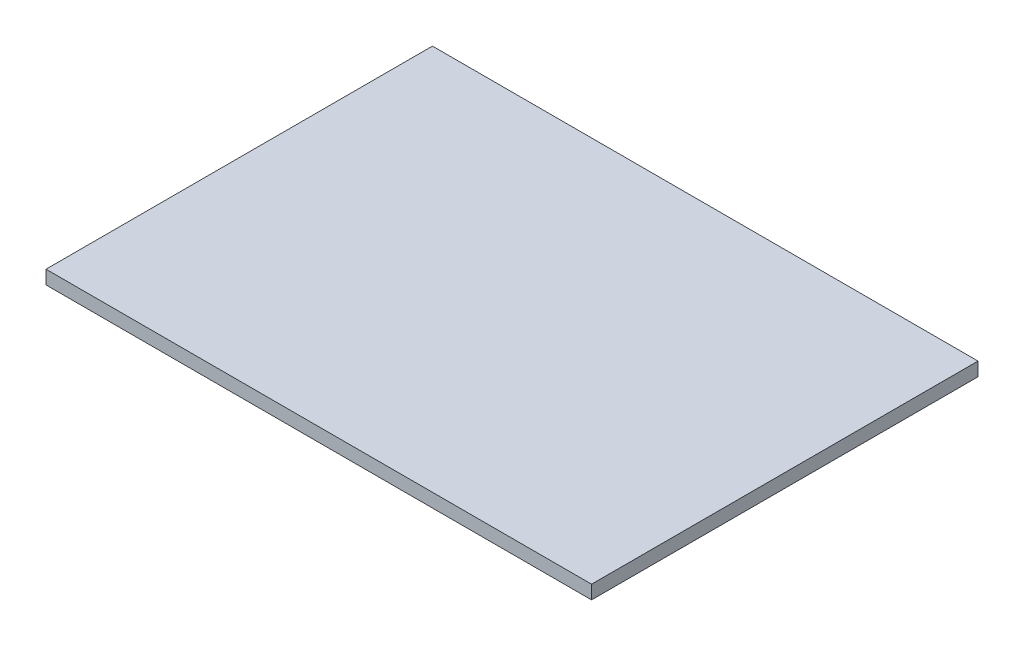
ISO-10303-21;
HEADER;
FILE_DESCRIPTION(('STEP AP214'),'2;1');
FILE_NAME('part.step','',(''),(''),'','','');
FILE_SCHEMA(('AUTOMOTIVE_DESIGN { 1 0 10303 214 1 1 1 1 }'));
ENDSEC;
DATA;
#1=APPLICATION_CONTEXT('core data for automotive mechanical design processes');
#2=APPLICATION_PROTOCOL_DEFINITION('international standard','automotive_design',2000,#1);
#3=PRODUCT_CONTEXT('',#1,'mechanical');
#4=PRODUCT('Part','Part','',(#3));
#5=PRODUCT_RELATED_PRODUCT_CATEGORY('part','',(#4));
#6=PRODUCT_DEFINITION_FORMATION('','',#4);
#7=PRODUCT_DEFINITION_CONTEXT('part definition',#1,'design');
#8=PRODUCT_DEFINITION('design','',#6,#7);
#9=PRODUCT_DEFINITION_SHAPE('','',#8);
#10=(LENGTH_UNIT() NAMED_UNIT(*) SI_UNIT(.MILLI.,.METRE.));
#11=(NAMED_UNIT(*) PLANE_ANGLE_UNIT() SI_UNIT($,.RADIAN.));
#12=(NAMED_UNIT(*) SI_UNIT($,.STERADIAN.) SOLID_ANGLE_UNIT());
#13=UNCERTAINTY_MEASURE_WITH_UNIT(LENGTH_MEASURE(1.E-05),#10,'distance_accuracy_value','');
#14=(GEOMETRIC_REPRESENTATION_CONTEXT(3) GLOBAL_UNCERTAINTY_ASSIGNED_CONTEXT((#13)) GLOBAL_UNIT_ASSIGNED_CONTEXT((#10,
#11,#12)) REPRESENTATION_CONTEXT('',''));
#15=CARTESIAN_POINT('',(0.,0.,0.));
#16=DIRECTION('',(0.,0.,1.));
#17=DIRECTION('',(1.,0.,0.));
#18=AXIS2_PLACEMENT_3D('',#15,#16,#17);
#19=CARTESIAN_POINT('',(60.,3.,-42.5));
#20=DIRECTION('',(-1.,0.,0.));
#21=DIRECTION('',(0.,0.,1.));
#22=AXIS2_PLACEMENT_3D('',#19,#20,#21);
#23=PLANE('',#22);
#24=DIRECTION('',(0.,0.,-1.));
#25=VECTOR('',#24,1.);
#26=CARTESIAN_POINT('',(60.,0.,-42.5));
#27=LINE('',#26,#25);
#28=CARTESIAN_POINT('',(60.,0.,42.5));
#29=VERTEX_POINT('',#28);
#30=CARTESIAN_POINT('',(60.,0.,-42.5));
#31=VERTEX_POINT('',#30);
#32=EDGE_CURVE('E97',#29,#31,#27,.T.);
#33=ORIENTED_EDGE('',*,*,#32,.T.);
#34=DIRECTION('',(0.,-1.,0.));
#35=VECTOR('',#34,1.);
#36=CARTESIAN_POINT('',(60.,3.,-42.5));
#37=LINE('',#36,#35);
#38=CARTESIAN_POINT('',(60.,3.,-42.5));
#39=VERTEX_POINT('',#38);
#40=EDGE_CURVE('E11',#39,#31,#37,.T.);
#41=ORIENTED_EDGE('',*,*,#40,.F.);
#42=DIRECTION('',(0.,0.,-1.));
#43=VECTOR('',#42,1.);
#44=CARTESIAN_POINT('',(60.,3.,-42.5));
#45=LINE('',#44,#43);
#46=CARTESIAN_POINT('',(60.,3.,42.5));
#47=VERTEX_POINT('',#46);
#48=EDGE_CURVE('E85',#47,#39,#45,.T.);
#49=ORIENTED_EDGE('',*,*,#48,.F.);
#50=DIRECTION('',(0.,-1.,0.));
#51=VECTOR('',#50,1.);
#52=CARTESIAN_POINT('',(60.,3.,42.5));
#53=LINE('',#52,#51);
#54=EDGE_CURVE('E93',#47,#29,#53,.T.);
#55=ORIENTED_EDGE('',*,*,#54,.T.);
#56=EDGE_LOOP('',(#33,#41,#49,#55));
#57=FACE_BOUND('',#56,.T.);
#58=ADVANCED_FACE('F34',(#57),#23,.F.);
#59=CARTESIAN_POINT('',(-60.,3.,-42.5));
#60=DIRECTION('',(0.,0.,1.));
#61=DIRECTION('',(1.,0.,0.));
#62=AXIS2_PLACEMENT_3D('',#59,#60,#61);
#63=PLANE('',#62);
#64=DIRECTION('',(-1.,0.,0.));
#65=VECTOR('',#64,1.);
#66=CARTESIAN_POINT('',(-60.,0.,-42.5));
#67=LINE('',#66,#65);
#68=CARTESIAN_POINT('',(-60.,0.,-42.5));
#69=VERTEX_POINT('',#68);
#70=EDGE_CURVE('E89',#31,#69,#67,.T.);
#71=ORIENTED_EDGE('',*,*,#70,.T.);
#72=DIRECTION('',(0.,-1.,0.));
#73=VECTOR('',#72,1.);
#74=CARTESIAN_POINT('',(-60.,3.,-42.5));
#75=LINE('',#74,#73);
#76=CARTESIAN_POINT('',(-60.,3.,-42.5));
#77=VERTEX_POINT('',#76);
#78=EDGE_CURVE('E42',#77,#69,#75,.T.);
#79=ORIENTED_EDGE('',*,*,#78,.F.);
#80=DIRECTION('',(-1.,0.,0.));
#81=VECTOR('',#80,1.);
#82=CARTESIAN_POINT('',(-60.,3.,-42.5));
#83=LINE('',#82,#81);
#84=EDGE_CURVE('E80',#39,#77,#83,.T.);
#85=ORIENTED_EDGE('',*,*,#84,.F.);
#86=ORIENTED_EDGE('',*,*,#40,.T.);
#87=EDGE_LOOP('',(#71,#79,#85,#86));
#88=FACE_BOUND('',#87,.T.);
#89=ADVANCED_FACE('F88',(#88),#63,.F.);
#90=CARTESIAN_POINT('',(-60.,3.,-42.5));
#91=DIRECTION('',(1.,0.,0.));
#92=DIRECTION('',(0.,0.,-1.));
#93=AXIS2_PLACEMENT_3D('',#90,#91,#92);
#94=PLANE('',#93);
#95=DIRECTION('',(0.,0.,1.));
#96=VECTOR('',#95,1.);
#97=CARTESIAN_POINT('',(-60.,0.,-42.5));
#98=LINE('',#97,#96);
#99=CARTESIAN_POINT('',(-60.,0.,42.5));
#100=VERTEX_POINT('',#99);
#101=EDGE_CURVE('E67',#69,#100,#98,.T.);
#102=ORIENTED_EDGE('',*,*,#101,.T.);
#103=DIRECTION('',(0.,-1.,0.));
#104=VECTOR('',#103,1.);
#105=CARTESIAN_POINT('',(-60.,3.,42.5));
#106=LINE('',#105,#104);
#107=CARTESIAN_POINT('',(-60.,3.,42.5));
#108=VERTEX_POINT('',#107);
#109=EDGE_CURVE('E90',#108,#100,#106,.T.);
#110=ORIENTED_EDGE('',*,*,#109,.F.);
#111=DIRECTION('',(0.,0.,1.));
#112=VECTOR('',#111,1.);
#113=CARTESIAN_POINT('',(-60.,3.,-42.5));
#114=LINE('',#113,#112);
#115=EDGE_CURVE('E83',#77,#108,#114,.T.);
#116=ORIENTED_EDGE('',*,*,#115,.F.);
#117=ORIENTED_EDGE('',*,*,#78,.T.);
#118=EDGE_LOOP('',(#102,#110,#116,#117));
#119=FACE_BOUND('',#118,.T.);
#120=ADVANCED_FACE('F91',(#119),#94,.F.);
#121=CARTESIAN_POINT('',(-60.,3.,42.5));
#122=DIRECTION('',(0.,0.,-1.));
#123=DIRECTION('',(-1.,0.,0.));
#124=AXIS2_PLACEMENT_3D('',#121,#122,#123);
#125=PLANE('',#124);
#126=DIRECTION('',(1.,0.,0.));
#127=VECTOR('',#126,1.);
#128=CARTESIAN_POINT('',(-60.,0.,42.5));
#129=LINE('',#128,#127);
#130=EDGE_CURVE('E73',#100,#29,#129,.T.);
#131=ORIENTED_EDGE('',*,*,#130,.T.);
#132=ORIENTED_EDGE('',*,*,#54,.F.);
#133=DIRECTION('',(1.,0.,0.));
#134=VECTOR('',#133,1.);
#135=CARTESIAN_POINT('',(-60.,3.,42.5));
#136=LINE('',#135,#134);
#137=EDGE_CURVE('E50',#108,#47,#136,.T.);
#138=ORIENTED_EDGE('',*,*,#137,.F.);
#139=ORIENTED_EDGE('',*,*,#109,.T.);
#140=EDGE_LOOP('',(#131,#132,#138,#139));
#141=FACE_BOUND('',#140,.T.);
#142=ADVANCED_FACE('F104',(#141),#125,.F.);
#143=CARTESIAN_POINT('',(0.,3.,0.));
#144=DIRECTION('',(0.,1.,0.));
#145=DIRECTION('',(0.,0.,1.));
#146=AXIS2_PLACEMENT_3D('',#143,#144,#145);
#147=PLANE('',#146);
#148=ORIENTED_EDGE('',*,*,#48,.T.);
#149=ORIENTED_EDGE('',*,*,#84,.T.);
#150=ORIENTED_EDGE('',*,*,#115,.T.);
#151=ORIENTED_EDGE('',*,*,#137,.T.);
#152=EDGE_LOOP('',(#148,#149,#150,#151));
#153=FACE_BOUND('',#152,.T.);
#154=ADVANCED_FACE('F81',(#153),#147,.T.);
#155=CARTESIAN_POINT('',(0.,0.,0.));
#156=DIRECTION('',(0.,1.,0.));
#157=DIRECTION('',(0.,0.,1.));
#158=AXIS2_PLACEMENT_3D('',#155,#156,#157);
#159=PLANE('',#158);
#160=ORIENTED_EDGE('',*,*,#32,.F.);
#161=ORIENTED_EDGE('',*,*,#130,.F.);
#162=ORIENTED_EDGE('',*,*,#101,.F.);
#163=ORIENTED_EDGE('',*,*,#70,.F.);
#164=EDGE_LOOP('',(#160,#161,#162,#163));
#165=FACE_BOUND('',#164,.T.);
#166=ADVANCED_FACE('F107',(#165),#159,.F.);
#167=CLOSED_SHELL('',(#58,#89,#120,#142,#154,#166));
#168=MANIFOLD_SOLID_BREP('B2',#167);
#169=ADVANCED_BREP_SHAPE_REPRESENTATION('',(#18,#168),#14);
#170=SHAPE_DEFINITION_REPRESENTATION(#9,#169);
ENDSEC;
END-ISO-10303-21;
